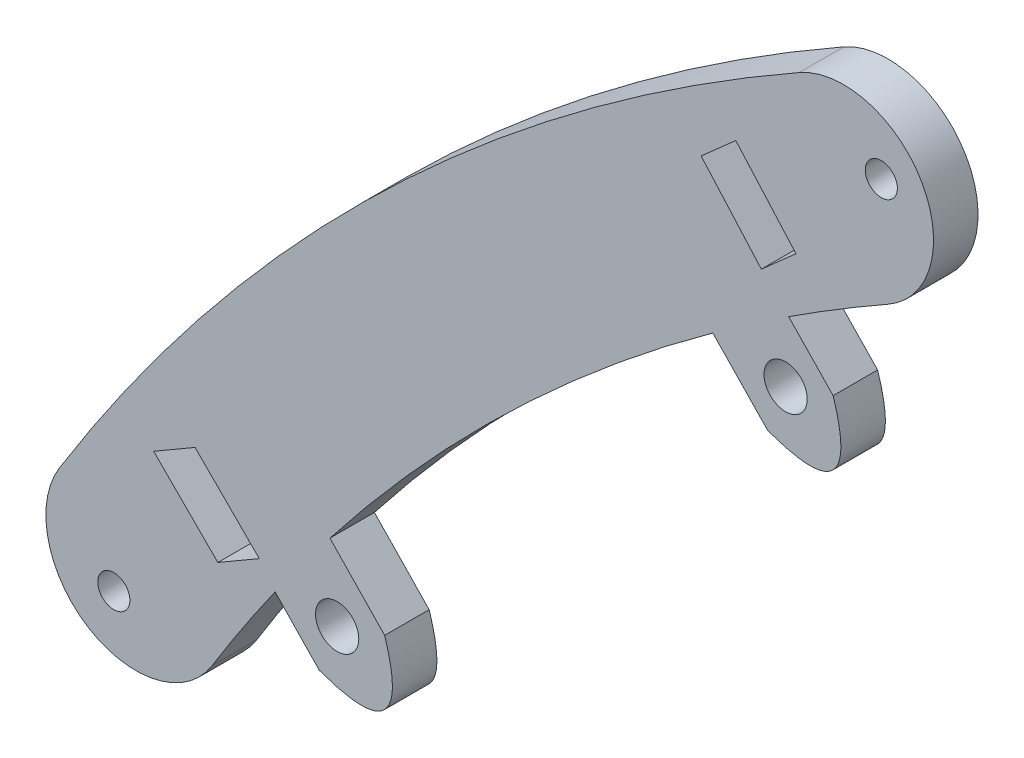
ISO-10303-21;
HEADER;
FILE_DESCRIPTION(('STEP AP214'),'2;1');
FILE_NAME('part.step','',(''),(''),'','','');
FILE_SCHEMA(('AUTOMOTIVE_DESIGN { 1 0 10303 214 1 1 1 1 }'));
ENDSEC;
DATA;
#1=APPLICATION_CONTEXT('core data for automotive mechanical design processes');
#2=APPLICATION_PROTOCOL_DEFINITION('international standard','automotive_design',2000,#1);
#3=PRODUCT_CONTEXT('',#1,'mechanical');
#4=PRODUCT('Part','Part','',(#3));
#5=PRODUCT_RELATED_PRODUCT_CATEGORY('part','',(#4));
#6=PRODUCT_DEFINITION_FORMATION('','',#4);
#7=PRODUCT_DEFINITION_CONTEXT('part definition',#1,'design');
#8=PRODUCT_DEFINITION('design','',#6,#7);
#9=PRODUCT_DEFINITION_SHAPE('','',#8);
#10=(LENGTH_UNIT() NAMED_UNIT(*) SI_UNIT(.MILLI.,.METRE.));
#11=(NAMED_UNIT(*) PLANE_ANGLE_UNIT() SI_UNIT($,.RADIAN.));
#12=(NAMED_UNIT(*) SI_UNIT($,.STERADIAN.) SOLID_ANGLE_UNIT());
#13=UNCERTAINTY_MEASURE_WITH_UNIT(LENGTH_MEASURE(1.E-05),#10,'distance_accuracy_value','');
#14=(GEOMETRIC_REPRESENTATION_CONTEXT(3) GLOBAL_UNCERTAINTY_ASSIGNED_CONTEXT((#13)) GLOBAL_UNIT_ASSIGNED_CONTEXT((#10,
#11,#12)) REPRESENTATION_CONTEXT('',''));
#15=CARTESIAN_POINT('',(0.,0.,0.));
#16=DIRECTION('',(0.,0.,1.));
#17=DIRECTION('',(1.,0.,0.));
#18=AXIS2_PLACEMENT_3D('',#15,#16,#17);
#19=CARTESIAN_POINT('',(229.674711958185,-179.16317055302,6.35));
#20=DIRECTION('',(0.,0.,-1.));
#21=DIRECTION('',(-1.,0.,0.));
#22=AXIS2_PLACEMENT_3D('',#19,#20,#21);
#23=CYLINDRICAL_SURFACE('',#22,295.200554539112);
#24=CARTESIAN_POINT('',(229.674711958185,-179.16317055302,0.));
#25=DIRECTION('',(0.,0.,1.));
#26=DIRECTION('',(1.,0.,0.));
#27=AXIS2_PLACEMENT_3D('',#24,#25,#26);
#28=CIRCLE('',#27,295.200554539112);
#29=CARTESIAN_POINT('',(84.1370748945815,77.6678314660947,0.));
#30=VERTEX_POINT('',#29);
#31=CARTESIAN_POINT('',(-21.4783743676533,-24.0325977145058,0.));
#32=VERTEX_POINT('',#31);
#33=EDGE_CURVE('E336',#30,#32,#28,.T.);
#34=ORIENTED_EDGE('',*,*,#33,.T.);
#35=DIRECTION('',(0.,0.,-1.));
#36=VECTOR('',#35,1.);
#37=CARTESIAN_POINT('',(-21.4783743676533,-24.0325977145058,6.35));
#38=LINE('',#37,#36);
#39=CARTESIAN_POINT('',(-21.4783743676533,-24.0325977145058,6.35));
#40=VERTEX_POINT('',#39);
#41=EDGE_CURVE('E11',#40,#32,#38,.T.);
#42=ORIENTED_EDGE('',*,*,#41,.F.);
#43=CARTESIAN_POINT('',(229.674711958185,-179.16317055302,6.35));
#44=DIRECTION('',(0.,0.,1.));
#45=DIRECTION('',(1.,0.,0.));
#46=AXIS2_PLACEMENT_3D('',#43,#44,#45);
#47=CIRCLE('',#46,295.200554539112);
#48=CARTESIAN_POINT('',(84.1370748945815,77.6678314660947,6.35));
#49=VERTEX_POINT('',#48);
#50=EDGE_CURVE('E223',#49,#40,#47,.T.);
#51=ORIENTED_EDGE('',*,*,#50,.F.);
#52=DIRECTION('',(0.,0.,-1.));
#53=VECTOR('',#52,1.);
#54=CARTESIAN_POINT('',(84.1370748945815,77.6678314660947,6.35));
#55=LINE('',#54,#53);
#56=EDGE_CURVE('E264',#49,#30,#55,.T.);
#57=ORIENTED_EDGE('',*,*,#56,.T.);
#58=EDGE_LOOP('',(#34,#42,#51,#57));
#59=FACE_BOUND('',#58,.T.);
#60=ADVANCED_FACE('F37',(#59),#23,.T.);
#61=CARTESIAN_POINT('',(-10.5653168250236,-30.7733027274293,6.35));
#62=DIRECTION('',(0.,0.,-1.));
#63=DIRECTION('',(-1.,0.,0.));
#64=AXIS2_PLACEMENT_3D('',#61,#62,#63);
#65=CYLINDRICAL_SURFACE('',#64,12.827);
#66=CARTESIAN_POINT('',(-10.5653168250236,-30.7733027274293,0.));
#67=DIRECTION('',(0.,0.,1.));
#68=DIRECTION('',(1.,0.,0.));
#69=AXIS2_PLACEMENT_3D('',#66,#67,#68);
#70=CIRCLE('',#69,12.827);
#71=CARTESIAN_POINT('',(0.347740717606099,-37.5140077403529,0.));
#72=VERTEX_POINT('',#71);
#73=EDGE_CURVE('E339',#32,#72,#70,.T.);
#74=ORIENTED_EDGE('',*,*,#73,.T.);
#75=DIRECTION('',(0.,0.,-1.));
#76=VECTOR('',#75,1.);
#77=CARTESIAN_POINT('',(0.347740717606099,-37.5140077403529,6.35));
#78=LINE('',#77,#76);
#79=CARTESIAN_POINT('',(0.347740717606099,-37.5140077403529,6.35));
#80=VERTEX_POINT('',#79);
#81=EDGE_CURVE('E47',#80,#72,#78,.T.);
#82=ORIENTED_EDGE('',*,*,#81,.F.);
#83=CARTESIAN_POINT('',(-10.5653168250236,-30.7733027274293,6.35));
#84=DIRECTION('',(0.,0.,1.));
#85=DIRECTION('',(1.,0.,0.));
#86=AXIS2_PLACEMENT_3D('',#83,#84,#85);
#87=CIRCLE('',#86,12.827);
#88=EDGE_CURVE('E218',#40,#80,#87,.T.);
#89=ORIENTED_EDGE('',*,*,#88,.F.);
#90=ORIENTED_EDGE('',*,*,#41,.T.);
#91=EDGE_LOOP('',(#74,#82,#89,#90));
#92=FACE_BOUND('',#91,.T.);
#93=ADVANCED_FACE('F399',(#92),#65,.T.);
#94=CARTESIAN_POINT('',(229.674711958185,-179.16317055302,6.35));
#95=DIRECTION('',(0.,0.,-1.));
#96=DIRECTION('',(-1.,0.,0.));
#97=AXIS2_PLACEMENT_3D('',#94,#95,#96);
#98=CYLINDRICAL_SURFACE('',#97,269.546554539113);
#99=CARTESIAN_POINT('',(229.674711958185,-179.16317055302,0.));
#100=DIRECTION('',(0.,0.,1.));
#101=DIRECTION('',(1.,0.,0.));
#102=AXIS2_PLACEMENT_3D('',#99,#100,#101);
#103=CIRCLE('',#102,269.546554539113);
#104=CARTESIAN_POINT('',(9.31768439930014,-23.9274611646204,0.));
#105=VERTEX_POINT('',#104);
#106=EDGE_CURVE('E342',#105,#72,#103,.T.);
#107=ORIENTED_EDGE('',*,*,#106,.F.);
#108=DIRECTION('',(0.,0.,-1.));
#109=VECTOR('',#108,1.);
#110=CARTESIAN_POINT('',(9.31768439930014,-23.9274611646204,6.35));
#111=LINE('',#110,#109);
#112=CARTESIAN_POINT('',(9.31768439930014,-23.9274611646204,6.35));
#113=VERTEX_POINT('',#112);
#114=EDGE_CURVE('E280',#113,#105,#111,.T.);
#115=ORIENTED_EDGE('',*,*,#114,.F.);
#116=CARTESIAN_POINT('',(229.674711958185,-179.16317055302,6.35));
#117=DIRECTION('',(0.,0.,1.));
#118=DIRECTION('',(1.,0.,0.));
#119=AXIS2_PLACEMENT_3D('',#116,#117,#118);
#120=CIRCLE('',#119,269.546554539113);
#121=EDGE_CURVE('E208',#113,#80,#120,.T.);
#122=ORIENTED_EDGE('',*,*,#121,.T.);
#123=ORIENTED_EDGE('',*,*,#81,.T.);
#124=EDGE_LOOP('',(#107,#115,#122,#123));
#125=FACE_BOUND('',#124,.T.);
#126=ADVANCED_FACE('F396',(#125),#98,.F.);
#127=CARTESIAN_POINT('',(-7.12046248091011,-6.85651594712229,6.35));
#128=DIRECTION('',(-0.720331621639593,-0.693629839947846,0.));
#129=DIRECTION('',(0.693629839947846,-0.720331621639593,0.));
#130=AXIS2_PLACEMENT_3D('',#127,#128,#129);
#131=PLANE('',#130);
#132=DIRECTION('',(-0.693629839947846,0.720331621639593,0.));
#133=VECTOR('',#132,1.);
#134=CARTESIAN_POINT('',(-7.12046248091011,-6.85651594712229,0.));
#135=LINE('',#134,#133);
#136=CARTESIAN_POINT('',(15.6217660169215,-30.4742229574968,0.));
#137=VERTEX_POINT('',#136);
#138=EDGE_CURVE('E345',#137,#105,#135,.T.);
#139=ORIENTED_EDGE('',*,*,#138,.F.);
#140=DIRECTION('',(0.,0.,-1.));
#141=VECTOR('',#140,1.);
#142=CARTESIAN_POINT('',(15.6217660169215,-30.4742229574968,6.35));
#143=LINE('',#142,#141);
#144=CARTESIAN_POINT('',(15.6217660169215,-30.4742229574968,6.35));
#145=VERTEX_POINT('',#144);
#146=EDGE_CURVE('E278',#145,#137,#143,.T.);
#147=ORIENTED_EDGE('',*,*,#146,.F.);
#148=DIRECTION('',(-0.693629839947846,0.720331621639593,0.));
#149=VECTOR('',#148,1.);
#150=CARTESIAN_POINT('',(-7.12046248091011,-6.85651594712229,6.35));
#151=LINE('',#150,#149);
#152=EDGE_CURVE('E217',#145,#113,#151,.T.);
#153=ORIENTED_EDGE('',*,*,#152,.T.);
#154=ORIENTED_EDGE('',*,*,#114,.T.);
#155=EDGE_LOOP('',(#139,#147,#153,#154));
#156=FACE_BOUND('',#155,.T.);
#157=ADVANCED_FACE('F394',(#156),#131,.T.);
#158=CARTESIAN_POINT('',(15.6217660169215,-30.4742229574968,6.35));
#159=CARTESIAN_POINT('',(29.4488168563122,-35.4957225427707,6.35));
#160=CARTESIAN_POINT('',(24.9529418436408,-21.4889420108124,6.35));
#161=B_SPLINE_CURVE_WITH_KNOTS('',2,(#158,#159,#160),.UNSPECIFIED.,.F.,.F.,(3,3),(0.,1.),.UNSPECIFIED.);
#162=DIRECTION('',(0.,0.,-1.));
#163=VECTOR('',#162,1.);
#164=SURFACE_OF_LINEAR_EXTRUSION('',#161,#163);
#165=CARTESIAN_POINT('',(15.6217660169215,-30.4742229574968,0.));
#166=CARTESIAN_POINT('',(29.4488168563122,-35.4957225427707,0.));
#167=CARTESIAN_POINT('',(24.9529418436408,-21.4889420108124,0.));
#168=B_SPLINE_CURVE_WITH_KNOTS('',2,(#165,#166,#167),.UNSPECIFIED.,.F.,.F.,(3,3),(0.,1.),.UNSPECIFIED.);
#169=CARTESIAN_POINT('',(24.9529418436408,-21.4889420108124,0.));
#170=VERTEX_POINT('',#169);
#171=EDGE_CURVE('E350',#137,#170,#168,.T.);
#172=ORIENTED_EDGE('',*,*,#171,.T.);
#173=DIRECTION('',(0.,0.,-1.));
#174=VECTOR('',#173,1.);
#175=CARTESIAN_POINT('',(24.9529418436408,-21.4889420108124,6.35));
#176=LINE('',#175,#174);
#177=CARTESIAN_POINT('',(24.9529418436408,-21.4889420108124,6.35));
#178=VERTEX_POINT('',#177);
#179=EDGE_CURVE('E275',#178,#170,#176,.T.);
#180=ORIENTED_EDGE('',*,*,#179,.F.);
#181=EDGE_CURVE('E222',#145,#178,#161,.T.);
#182=ORIENTED_EDGE('',*,*,#181,.F.);
#183=ORIENTED_EDGE('',*,*,#146,.T.);
#184=EDGE_LOOP('',(#172,#180,#182,#183));
#185=FACE_BOUND('',#184,.T.);
#186=ADVANCED_FACE('F390',(#185),#164,.F.);
#187=CARTESIAN_POINT('',(2.21071334580914,2.12876499956209,6.35));
#188=DIRECTION('',(-0.720331621639592,-0.693629839947847,0.));
#189=DIRECTION('',(0.693629839947847,-0.720331621639592,0.));
#190=AXIS2_PLACEMENT_3D('',#187,#188,#189);
#191=PLANE('',#190);
#192=DIRECTION('',(-0.693629839947847,0.720331621639592,0.));
#193=VECTOR('',#192,1.);
#194=CARTESIAN_POINT('',(2.21071334580914,2.12876499956209,0.));
#195=LINE('',#194,#193);
#196=CARTESIAN_POINT('',(17.1416872619347,-13.3769875419806,0.));
#197=VERTEX_POINT('',#196);
#198=EDGE_CURVE('E354',#170,#197,#195,.T.);
#199=ORIENTED_EDGE('',*,*,#198,.T.);
#200=DIRECTION('',(0.,0.,-1.));
#201=VECTOR('',#200,1.);
#202=CARTESIAN_POINT('',(17.1416872619347,-13.3769875419806,6.35));
#203=LINE('',#202,#201);
#204=CARTESIAN_POINT('',(17.1416872619347,-13.3769875419806,6.35));
#205=VERTEX_POINT('',#204);
#206=EDGE_CURVE('E273',#205,#197,#203,.T.);
#207=ORIENTED_EDGE('',*,*,#206,.F.);
#208=DIRECTION('',(-0.693629839947847,0.720331621639592,0.));
#209=VECTOR('',#208,1.);
#210=CARTESIAN_POINT('',(2.21071334580914,2.12876499956209,6.35));
#211=LINE('',#210,#209);
#212=EDGE_CURVE('E215',#178,#205,#211,.T.);
#213=ORIENTED_EDGE('',*,*,#212,.F.);
#214=ORIENTED_EDGE('',*,*,#179,.T.);
#215=EDGE_LOOP('',(#199,#207,#213,#214));
#216=FACE_BOUND('',#215,.T.);
#217=ADVANCED_FACE('F386',(#216),#191,.F.);
#218=CARTESIAN_POINT('',(71.7848233068366,39.2999341708021,0.));
#219=VERTEX_POINT('',#218);
#220=EDGE_CURVE('E347',#219,#197,#103,.T.);
#221=ORIENTED_EDGE('',*,*,#220,.F.);
#222=DIRECTION('',(0.,0.,-1.));
#223=VECTOR('',#222,1.);
#224=CARTESIAN_POINT('',(71.7848233068366,39.2999341708021,6.35));
#225=LINE('',#224,#223);
#226=CARTESIAN_POINT('',(71.7848233068366,39.2999341708021,6.35));
#227=VERTEX_POINT('',#226);
#228=EDGE_CURVE('E271',#227,#219,#225,.T.);
#229=ORIENTED_EDGE('',*,*,#228,.F.);
#230=EDGE_CURVE('E207',#227,#205,#120,.T.);
#231=ORIENTED_EDGE('',*,*,#230,.T.);
#232=ORIENTED_EDGE('',*,*,#206,.T.);
#233=EDGE_LOOP('',(#221,#229,#231,#232));
#234=FACE_BOUND('',#233,.T.);
#235=ADVANCED_FACE('F381',(#234),#98,.F.);
#236=CARTESIAN_POINT('',(56.8834970245663,54.7748977714104,6.35));
#237=DIRECTION('',(-0.720331621639599,-0.69362983994784,0.));
#238=DIRECTION('',(0.69362983994784,-0.720331621639599,0.));
#239=AXIS2_PLACEMENT_3D('',#236,#237,#238);
#240=PLANE('',#239);
#241=DIRECTION('',(-0.69362983994784,0.720331621639599,0.));
#242=VECTOR('',#241,1.);
#243=CARTESIAN_POINT('',(56.8834970245663,54.7748977714104,0.));
#244=LINE('',#243,#242);
#245=CARTESIAN_POINT('',(79.625725522398,31.1571907610353,0.));
#246=VERTEX_POINT('',#245);
#247=EDGE_CURVE('E360',#246,#219,#244,.T.);
#248=ORIENTED_EDGE('',*,*,#247,.F.);
#249=DIRECTION('',(0.,0.,-1.));
#250=VECTOR('',#249,1.);
#251=CARTESIAN_POINT('',(79.625725522398,31.1571907610353,6.35));
#252=LINE('',#251,#250);
#253=CARTESIAN_POINT('',(79.625725522398,31.1571907610353,6.35));
#254=VERTEX_POINT('',#253);
#255=EDGE_CURVE('E269',#254,#246,#252,.T.);
#256=ORIENTED_EDGE('',*,*,#255,.F.);
#257=DIRECTION('',(-0.69362983994784,0.720331621639599,0.));
#258=VECTOR('',#257,1.);
#259=CARTESIAN_POINT('',(56.8834970245663,54.7748977714104,6.35));
#260=LINE('',#259,#258);
#261=EDGE_CURVE('E214',#254,#227,#260,.T.);
#262=ORIENTED_EDGE('',*,*,#261,.T.);
#263=ORIENTED_EDGE('',*,*,#228,.T.);
#264=EDGE_LOOP('',(#248,#256,#262,#263));
#265=FACE_BOUND('',#264,.T.);
#266=ADVANCED_FACE('F508',(#265),#240,.T.);
#267=CARTESIAN_POINT('',(79.625725522398,31.1571907610353,6.35));
#268=CARTESIAN_POINT('',(93.4527763617898,26.1356911757603,6.35));
#269=CARTESIAN_POINT('',(88.9569013491174,40.1424717077196,6.35));
#270=B_SPLINE_CURVE_WITH_KNOTS('',2,(#267,#268,#269),.UNSPECIFIED.,.F.,.F.,(3,3),(0.,1.),.UNSPECIFIED.);
#271=DIRECTION('',(0.,0.,-1.));
#272=VECTOR('',#271,1.);
#273=SURFACE_OF_LINEAR_EXTRUSION('',#270,#272);
#274=CARTESIAN_POINT('',(79.625725522398,31.1571907610353,0.));
#275=CARTESIAN_POINT('',(93.4527763617898,26.1356911757603,0.));
#276=CARTESIAN_POINT('',(88.9569013491174,40.1424717077196,0.));
#277=B_SPLINE_CURVE_WITH_KNOTS('',2,(#274,#275,#276),.UNSPECIFIED.,.F.,.F.,(3,3),(0.,1.),.UNSPECIFIED.);
#278=CARTESIAN_POINT('',(88.9569013491174,40.1424717077196,0.));
#279=VERTEX_POINT('',#278);
#280=EDGE_CURVE('E363',#246,#279,#277,.T.);
#281=ORIENTED_EDGE('',*,*,#280,.T.);
#282=DIRECTION('',(0.,0.,-1.));
#283=VECTOR('',#282,1.);
#284=CARTESIAN_POINT('',(88.9569013491174,40.1424717077196,6.35));
#285=LINE('',#284,#283);
#286=CARTESIAN_POINT('',(88.9569013491174,40.1424717077196,6.35));
#287=VERTEX_POINT('',#286);
#288=EDGE_CURVE('E203',#287,#279,#285,.T.);
#289=ORIENTED_EDGE('',*,*,#288,.F.);
#290=EDGE_CURVE('E190',#254,#287,#270,.T.);
#291=ORIENTED_EDGE('',*,*,#290,.F.);
#292=ORIENTED_EDGE('',*,*,#255,.T.);
#293=EDGE_LOOP('',(#281,#289,#291,#292));
#294=FACE_BOUND('',#293,.T.);
#295=ADVANCED_FACE('F504',(#294),#273,.F.);
#296=CARTESIAN_POINT('',(66.2146728512855,63.7601787180948,6.35));
#297=DIRECTION('',(-0.720331621639598,-0.693629839947841,0.));
#298=DIRECTION('',(0.693629839947841,-0.720331621639598,0.));
#299=AXIS2_PLACEMENT_3D('',#296,#297,#298);
#300=PLANE('',#299);
#301=DIRECTION('',(-0.693629839947841,0.720331621639598,0.));
#302=VECTOR('',#301,1.);
#303=CARTESIAN_POINT('',(66.2146728512855,63.7601787180948,0.));
#304=LINE('',#303,#302);
#305=CARTESIAN_POINT('',(82.6127266678664,46.7308699756691,0.));
#306=VERTEX_POINT('',#305);
#307=EDGE_CURVE('E199',#279,#306,#304,.T.);
#308=ORIENTED_EDGE('',*,*,#307,.T.);
#309=DIRECTION('',(0.,0.,-1.));
#310=VECTOR('',#309,1.);
#311=CARTESIAN_POINT('',(82.6127266678664,46.7308699756691,6.35));
#312=LINE('',#311,#310);
#313=CARTESIAN_POINT('',(82.6127266678664,46.7308699756691,6.35));
#314=VERTEX_POINT('',#313);
#315=EDGE_CURVE('E196',#314,#306,#312,.T.);
#316=ORIENTED_EDGE('',*,*,#315,.F.);
#317=DIRECTION('',(-0.693629839947841,0.720331621639598,0.));
#318=VECTOR('',#317,1.);
#319=CARTESIAN_POINT('',(66.2146728512855,63.7601787180948,6.35));
#320=LINE('',#319,#318);
#321=EDGE_CURVE('E182',#287,#314,#320,.T.);
#322=ORIENTED_EDGE('',*,*,#321,.F.);
#323=ORIENTED_EDGE('',*,*,#288,.T.);
#324=EDGE_LOOP('',(#308,#316,#322,#323));
#325=FACE_BOUND('',#324,.T.);
#326=ADVANCED_FACE('F197',(#325),#300,.F.);
#327=CARTESIAN_POINT('',(96.7848239716755,55.3482848917831,0.));
#328=VERTEX_POINT('',#327);
#329=EDGE_CURVE('E346',#328,#306,#103,.T.);
#330=ORIENTED_EDGE('',*,*,#329,.F.);
#331=DIRECTION('',(0.,0.,-1.));
#332=VECTOR('',#331,1.);
#333=CARTESIAN_POINT('',(96.7848239716755,55.3482848917831,6.35));
#334=LINE('',#333,#332);
#335=CARTESIAN_POINT('',(96.7848239716755,55.3482848917831,6.35));
#336=VERTEX_POINT('',#335);
#337=EDGE_CURVE('E120',#336,#328,#334,.T.);
#338=ORIENTED_EDGE('',*,*,#337,.F.);
#339=EDGE_CURVE('E187',#336,#314,#120,.T.);
#340=ORIENTED_EDGE('',*,*,#339,.T.);
#341=ORIENTED_EDGE('',*,*,#315,.T.);
#342=EDGE_LOOP('',(#330,#338,#340,#341));
#343=FACE_BOUND('',#342,.T.);
#344=ADVANCED_FACE('F205',(#343),#98,.F.);
#345=CARTESIAN_POINT('',(-6.94480742537235,-6.94480742537235,6.35));
#346=DIRECTION('',(0.707106781186547,0.707106781186548,0.));
#347=DIRECTION('',(-0.707106781186548,0.707106781186547,0.));
#348=AXIS2_PLACEMENT_3D('',#345,#346,#347);
#349=PLANE('',#348);
#350=DIRECTION('',(0.707106781186548,-0.707106781186547,0.));
#351=VECTOR('',#350,1.);
#352=CARTESIAN_POINT('',(-6.94480742537235,-6.94480742537235,0.));
#353=LINE('',#352,#351);
#354=CARTESIAN_POINT('',(-2.10093048234013,-11.7886843684046,0.));
#355=VERTEX_POINT('',#354);
#356=CARTESIAN_POINT('',(7.0605629144832,-20.9501777652279,0.));
#357=VERTEX_POINT('',#356);
#358=EDGE_CURVE('E324',#355,#357,#353,.T.);
#359=ORIENTED_EDGE('',*,*,#358,.T.);
#360=DIRECTION('',(0.,0.,-1.));
#361=VECTOR('',#360,1.);
#362=CARTESIAN_POINT('',(7.0605629144832,-20.9501777652279,6.35));
#363=LINE('',#362,#361);
#364=CARTESIAN_POINT('',(7.0605629144832,-20.9501777652279,6.35));
#365=VERTEX_POINT('',#364);
#366=EDGE_CURVE('E266',#365,#357,#363,.T.);
#367=ORIENTED_EDGE('',*,*,#366,.F.);
#368=DIRECTION('',(0.707106781186548,-0.707106781186547,0.));
#369=VECTOR('',#368,1.);
#370=CARTESIAN_POINT('',(-6.94480742537235,-6.94480742537235,6.35));
#371=LINE('',#370,#369);
#372=CARTESIAN_POINT('',(-2.10093048234013,-11.7886843684046,6.35));
#373=VERTEX_POINT('',#372);
#374=EDGE_CURVE('E235',#373,#365,#371,.T.);
#375=ORIENTED_EDGE('',*,*,#374,.F.);
#376=DIRECTION('',(0.,0.,-1.));
#377=VECTOR('',#376,1.);
#378=CARTESIAN_POINT('',(-2.10093048234013,-11.7886843684046,6.35));
#379=LINE('',#378,#377);
#380=EDGE_CURVE('E283',#373,#355,#379,.T.);
#381=ORIENTED_EDGE('',*,*,#380,.T.);
#382=EDGE_LOOP('',(#359,#367,#375,#381));
#383=FACE_BOUND('',#382,.T.);
#384=ADVANCED_FACE('F433',(#383),#349,.F.);
#385=CARTESIAN_POINT('',(10.8733608503817,-18.737628400949,6.35));
#386=DIRECTION('',(0.501909305167918,-0.864920256084836,0.));
#387=DIRECTION('',(0.864920256084836,0.501909305167918,0.));
#388=AXIS2_PLACEMENT_3D('',#385,#386,#387);
#389=PLANE('',#388);
#390=DIRECTION('',(-0.864920256084836,-0.501909305167918,0.));
#391=VECTOR('',#390,1.);
#392=CARTESIAN_POINT('',(10.8733608503817,-18.737628400949,0.));
#393=LINE('',#392,#391);
#394=CARTESIAN_POINT('',(1.15061344463446,-24.37969466129,0.));
#395=VERTEX_POINT('',#394);
#396=EDGE_CURVE('E327',#357,#395,#393,.T.);
#397=ORIENTED_EDGE('',*,*,#396,.T.);
#398=DIRECTION('',(0.,0.,-1.));
#399=VECTOR('',#398,1.);
#400=CARTESIAN_POINT('',(1.15061344463446,-24.37969466129,6.35));
#401=LINE('',#400,#399);
#402=CARTESIAN_POINT('',(1.15061344463446,-24.37969466129,6.35));
#403=VERTEX_POINT('',#402);
#404=EDGE_CURVE('E287',#403,#395,#401,.T.);
#405=ORIENTED_EDGE('',*,*,#404,.F.);
#406=DIRECTION('',(-0.864920256084836,-0.501909305167918,0.));
#407=VECTOR('',#406,1.);
#408=CARTESIAN_POINT('',(10.8733608503817,-18.737628400949,6.35));
#409=LINE('',#408,#407);
#410=EDGE_CURVE('E233',#365,#403,#409,.T.);
#411=ORIENTED_EDGE('',*,*,#410,.F.);
#412=ORIENTED_EDGE('',*,*,#366,.T.);
#413=EDGE_LOOP('',(#397,#405,#411,#412));
#414=FACE_BOUND('',#413,.T.);
#415=ADVANCED_FACE('F429',(#414),#389,.F.);
#416=CARTESIAN_POINT('',(-11.6145406083278,-11.6145406083278,6.35));
#417=DIRECTION('',(0.707106781186547,0.707106781186548,0.));
#418=DIRECTION('',(-0.707106781186548,0.707106781186547,0.));
#419=AXIS2_PLACEMENT_3D('',#416,#417,#418);
#420=PLANE('',#419);
#421=DIRECTION('',(0.707106781186548,-0.707106781186547,0.));
#422=VECTOR('',#421,1.);
#423=CARTESIAN_POINT('',(-11.6145406083278,-11.6145406083278,0.));
#424=LINE('',#423,#422);
#425=CARTESIAN_POINT('',(-8.01087995218896,-15.2182012644665,0.));
#426=VERTEX_POINT('',#425);
#427=EDGE_CURVE('E330',#426,#395,#424,.T.);
#428=ORIENTED_EDGE('',*,*,#427,.F.);
#429=DIRECTION('',(0.,0.,-1.));
#430=VECTOR('',#429,1.);
#431=CARTESIAN_POINT('',(-8.01087995218896,-15.2182012644665,6.35));
#432=LINE('',#431,#430);
#433=CARTESIAN_POINT('',(-8.01087995218896,-15.2182012644665,6.35));
#434=VERTEX_POINT('',#433);
#435=EDGE_CURVE('E285',#434,#426,#432,.T.);
#436=ORIENTED_EDGE('',*,*,#435,.F.);
#437=DIRECTION('',(0.707106781186548,-0.707106781186547,0.));
#438=VECTOR('',#437,1.);
#439=CARTESIAN_POINT('',(-11.6145406083278,-11.6145406083278,6.35));
#440=LINE('',#439,#438);
#441=EDGE_CURVE('E230',#434,#403,#440,.T.);
#442=ORIENTED_EDGE('',*,*,#441,.T.);
#443=ORIENTED_EDGE('',*,*,#404,.T.);
#444=EDGE_LOOP('',(#428,#436,#442,#443));
#445=FACE_BOUND('',#444,.T.);
#446=ADVANCED_FACE('F426',(#445),#420,.T.);
#447=CARTESIAN_POINT('',(74.1668802422229,65.7311017479108,6.35));
#448=DIRECTION('',(0.748385625500297,0.66326386570092,0.));
#449=DIRECTION('',(-0.66326386570092,0.748385625500298,0.));
#450=AXIS2_PLACEMENT_3D('',#447,#448,#449);
#451=PLANE('',#450);
#452=DIRECTION('',(0.66326386570092,-0.748385625500298,0.));
#453=VECTOR('',#452,1.);
#454=CARTESIAN_POINT('',(74.1668802422229,65.7311017479108,0.));
#455=LINE('',#454,#453);
#456=CARTESIAN_POINT('',(75.0607858043629,64.7224744008544,0.));
#457=VERTEX_POINT('',#456);
#458=CARTESIAN_POINT('',(83.6527059206434,55.0278870081339,0.));
#459=VERTEX_POINT('',#458);
#460=EDGE_CURVE('E307',#457,#459,#455,.T.);
#461=ORIENTED_EDGE('',*,*,#460,.T.);
#462=DIRECTION('',(0.,0.,-1.));
#463=VECTOR('',#462,1.);
#464=CARTESIAN_POINT('',(83.6527059206434,55.0278870081339,6.35));
#465=LINE('',#464,#463);
#466=CARTESIAN_POINT('',(83.6527059206434,55.0278870081339,6.35));
#467=VERTEX_POINT('',#466);
#468=EDGE_CURVE('E41',#467,#459,#465,.T.);
#469=ORIENTED_EDGE('',*,*,#468,.F.);
#470=DIRECTION('',(0.66326386570092,-0.748385625500298,0.));
#471=VECTOR('',#470,1.);
#472=CARTESIAN_POINT('',(74.1668802422229,65.7311017479108,6.35));
#473=LINE('',#472,#471);
#474=CARTESIAN_POINT('',(75.0607858043629,64.7224744008544,6.35));
#475=VERTEX_POINT('',#474);
#476=EDGE_CURVE('E245',#475,#467,#473,.T.);
#477=ORIENTED_EDGE('',*,*,#476,.F.);
#478=DIRECTION('',(0.,0.,-1.));
#479=VECTOR('',#478,1.);
#480=CARTESIAN_POINT('',(75.0607858043629,64.7224744008544,6.35));
#481=LINE('',#480,#479);
#482=EDGE_CURVE('E291',#475,#457,#481,.T.);
#483=ORIENTED_EDGE('',*,*,#482,.T.);
#484=EDGE_LOOP('',(#461,#469,#477,#483));
#485=FACE_BOUND('',#484,.T.);
#486=ADVANCED_FACE('F308',(#485),#451,.F.);
#487=CARTESIAN_POINT('',(9.48582567842048,-10.7032147397769,6.35));
#488=DIRECTION('',(0.66326386570092,-0.748385625500297,0.));
#489=DIRECTION('',(0.748385625500298,0.66326386570092,0.));
#490=AXIS2_PLACEMENT_3D('',#487,#488,#489);
#491=PLANE('',#490);
#492=DIRECTION('',(-0.748385625500298,-0.66326386570092,0.));
#493=VECTOR('',#492,1.);
#494=CARTESIAN_POINT('',(9.48582567842048,-10.7032147397769,0.));
#495=LINE('',#494,#493);
#496=CARTESIAN_POINT('',(78.7103672498394,50.6476924390451,0.));
#497=VERTEX_POINT('',#496);
#498=EDGE_CURVE('E302',#459,#497,#495,.T.);
#499=ORIENTED_EDGE('',*,*,#498,.T.);
#500=DIRECTION('',(0.,0.,-1.));
#501=VECTOR('',#500,1.);
#502=CARTESIAN_POINT('',(78.7103672498394,50.6476924390451,6.35));
#503=LINE('',#502,#501);
#504=CARTESIAN_POINT('',(78.7103672498394,50.6476924390451,6.35));
#505=VERTEX_POINT('',#504);
#506=EDGE_CURVE('E295',#505,#497,#503,.T.);
#507=ORIENTED_EDGE('',*,*,#506,.F.);
#508=DIRECTION('',(-0.748385625500298,-0.66326386570092,0.));
#509=VECTOR('',#508,1.);
#510=CARTESIAN_POINT('',(9.48582567842048,-10.7032147397769,6.35));
#511=LINE('',#510,#509);
#512=EDGE_CURVE('E132',#467,#505,#511,.T.);
#513=ORIENTED_EDGE('',*,*,#512,.F.);
#514=ORIENTED_EDGE('',*,*,#468,.T.);
#515=EDGE_LOOP('',(#499,#507,#513,#514));
#516=FACE_BOUND('',#515,.T.);
#517=ADVANCED_FACE('F301',(#516),#491,.F.);
#518=CARTESIAN_POINT('',(69.2245415714189,61.350907178822,6.35));
#519=DIRECTION('',(0.748385625500297,0.66326386570092,0.));
#520=DIRECTION('',(-0.66326386570092,0.748385625500298,0.));
#521=AXIS2_PLACEMENT_3D('',#518,#519,#520);
#522=PLANE('',#521);
#523=DIRECTION('',(0.66326386570092,-0.748385625500298,0.));
#524=VECTOR('',#523,1.);
#525=CARTESIAN_POINT('',(69.2245415714189,61.350907178822,0.));
#526=LINE('',#525,#524);
#527=CARTESIAN_POINT('',(70.1184471335589,60.3422798317655,0.));
#528=VERTEX_POINT('',#527);
#529=EDGE_CURVE('E314',#528,#497,#526,.T.);
#530=ORIENTED_EDGE('',*,*,#529,.F.);
#531=DIRECTION('',(0.,0.,-1.));
#532=VECTOR('',#531,1.);
#533=CARTESIAN_POINT('',(70.1184471335589,60.3422798317655,6.35));
#534=LINE('',#533,#532);
#535=CARTESIAN_POINT('',(70.1184471335589,60.3422798317655,6.35));
#536=VERTEX_POINT('',#535);
#537=EDGE_CURVE('E293',#536,#528,#534,.T.);
#538=ORIENTED_EDGE('',*,*,#537,.F.);
#539=DIRECTION('',(0.66326386570092,-0.748385625500298,0.));
#540=VECTOR('',#539,1.);
#541=CARTESIAN_POINT('',(69.2245415714189,61.350907178822,6.35));
#542=LINE('',#541,#540);
#543=EDGE_CURVE('E241',#536,#505,#542,.T.);
#544=ORIENTED_EDGE('',*,*,#543,.T.);
#545=ORIENTED_EDGE('',*,*,#506,.T.);
#546=EDGE_LOOP('',(#530,#538,#544,#545));
#547=FACE_BOUND('',#546,.T.);
#548=ADVANCED_FACE('F414',(#547),#522,.T.);
#549=CARTESIAN_POINT('',(18.1731656441368,-23.786006992875,6.35));
#550=DIRECTION('',(0.,0.,-1.));
#551=DIRECTION('',(-1.,0.,0.));
#552=AXIS2_PLACEMENT_3D('',#549,#550,#551);
#553=CYLINDRICAL_SURFACE('',#552,3.0861);
#554=CARTESIAN_POINT('',(18.1731656441368,-23.786006992875,6.35));
#555=DIRECTION('',(0.,0.,1.));
#556=DIRECTION('',(1.,0.,0.));
#557=AXIS2_PLACEMENT_3D('',#554,#555,#556);
#558=CIRCLE('',#557,3.0861);
#559=CARTESIAN_POINT('',(21.2592656441368,-23.786006992875,6.35));
#560=VERTEX_POINT('',#559);
#561=EDGE_CURVE('E209',#560,#560,#558,.T.);
#562=ORIENTED_EDGE('',*,*,#561,.T.);
#563=EDGE_LOOP('',(#562));
#564=FACE_BOUND('',#563,.T.);
#565=CARTESIAN_POINT('',(18.1731656441368,-23.786006992875,0.));
#566=DIRECTION('',(0.,0.,1.));
#567=DIRECTION('',(1.,0.,0.));
#568=AXIS2_PLACEMENT_3D('',#565,#566,#567);
#569=CIRCLE('',#568,3.0861);
#570=CARTESIAN_POINT('',(21.2592656441368,-23.786006992875,0.));
#571=VERTEX_POINT('',#570);
#572=EDGE_CURVE('E256',#571,#571,#569,.T.);
#573=ORIENTED_EDGE('',*,*,#572,.F.);
#574=EDGE_LOOP('',(#573));
#575=FACE_BOUND('',#574,.T.);
#576=ADVANCED_FACE('F405',(#564,#575),#553,.F.);
#577=CARTESIAN_POINT('',(90.4609494331284,66.5080581789389,6.35));
#578=DIRECTION('',(0.,0.,-1.));
#579=DIRECTION('',(-1.,0.,0.));
#580=AXIS2_PLACEMENT_3D('',#577,#578,#579);
#581=CYLINDRICAL_SURFACE('',#580,12.827);
#582=CARTESIAN_POINT('',(90.4609494331284,66.5080581789389,0.));
#583=DIRECTION('',(0.,0.,1.));
#584=DIRECTION('',(1.,0.,0.));
#585=AXIS2_PLACEMENT_3D('',#582,#583,#584);
#586=CIRCLE('',#585,12.827);
#587=EDGE_CURVE('E123',#328,#30,#586,.T.);
#588=ORIENTED_EDGE('',*,*,#587,.T.);
#589=ORIENTED_EDGE('',*,*,#56,.F.);
#590=CARTESIAN_POINT('',(90.4609494331284,66.5080581789389,6.35));
#591=DIRECTION('',(0.,0.,1.));
#592=DIRECTION('',(1.,0.,0.));
#593=AXIS2_PLACEMENT_3D('',#590,#591,#592);
#594=CIRCLE('',#593,12.827);
#595=EDGE_CURVE('E56',#336,#49,#594,.T.);
#596=ORIENTED_EDGE('',*,*,#595,.F.);
#597=ORIENTED_EDGE('',*,*,#337,.T.);
#598=EDGE_LOOP('',(#588,#589,#596,#597));
#599=FACE_BOUND('',#598,.T.);
#600=ADVANCED_FACE('F402',(#599),#581,.T.);
#601=CARTESIAN_POINT('',(4.58835214920787,-7.90692397020364,6.35));
#602=DIRECTION('',(0.501909305167901,-0.864920256084846,0.));
#603=DIRECTION('',(0.864920256084846,0.501909305167901,0.));
#604=AXIS2_PLACEMENT_3D('',#601,#602,#603);
#605=PLANE('',#604);
#606=DIRECTION('',(-0.864920256084846,-0.501909305167901,0.));
#607=VECTOR('',#606,1.);
#608=CARTESIAN_POINT('',(4.58835214920787,-7.90692397020364,0.));
#609=LINE('',#608,#607);
#610=EDGE_CURVE('E333',#355,#426,#609,.T.);
#611=ORIENTED_EDGE('',*,*,#610,.F.);
#612=ORIENTED_EDGE('',*,*,#380,.F.);
#613=DIRECTION('',(-0.864920256084846,-0.501909305167901,0.));
#614=VECTOR('',#613,1.);
#615=CARTESIAN_POINT('',(4.58835214920787,-7.90692397020364,6.35));
#616=LINE('',#615,#614);
#617=EDGE_CURVE('E225',#373,#434,#616,.T.);
#618=ORIENTED_EDGE('',*,*,#617,.T.);
#619=ORIENTED_EDGE('',*,*,#435,.T.);
#620=EDGE_LOOP('',(#611,#612,#618,#619));
#621=FACE_BOUND('',#620,.T.);
#622=ADVANCED_FACE('F404',(#621),#605,.T.);
#623=CARTESIAN_POINT('',(0.893905562139995,-1.00862734705647,6.35));
#624=DIRECTION('',(0.66326386570092,-0.748385625500297,0.));
#625=DIRECTION('',(0.748385625500298,0.66326386570092,0.));
#626=AXIS2_PLACEMENT_3D('',#623,#624,#625);
#627=PLANE('',#626);
#628=DIRECTION('',(-0.748385625500298,-0.66326386570092,0.));
#629=VECTOR('',#628,1.);
#630=CARTESIAN_POINT('',(0.893905562139995,-1.00862734705647,0.));
#631=LINE('',#630,#629);
#632=EDGE_CURVE('E322',#457,#528,#631,.T.);
#633=ORIENTED_EDGE('',*,*,#632,.F.);
#634=ORIENTED_EDGE('',*,*,#482,.F.);
#635=DIRECTION('',(-0.748385625500298,-0.66326386570092,0.));
#636=VECTOR('',#635,1.);
#637=CARTESIAN_POINT('',(0.893905562139995,-1.00862734705647,6.35));
#638=LINE('',#637,#636);
#639=EDGE_CURVE('E238',#475,#536,#638,.T.);
#640=ORIENTED_EDGE('',*,*,#639,.T.);
#641=ORIENTED_EDGE('',*,*,#537,.T.);
#642=EDGE_LOOP('',(#633,#634,#640,#641));
#643=FACE_BOUND('',#642,.T.);
#644=ADVANCED_FACE('F411',(#643),#627,.T.);
#645=CARTESIAN_POINT('',(-13.6994246682668,-35.3440423781478,6.35));
#646=DIRECTION('',(0.,0.,-1.));
#647=DIRECTION('',(-1.,0.,0.));
#648=AXIS2_PLACEMENT_3D('',#645,#646,#647);
#649=CYLINDRICAL_SURFACE('',#648,2.29235);
#650=CARTESIAN_POINT('',(-13.6994246682668,-35.3440423781478,6.35));
#651=DIRECTION('',(0.,0.,1.));
#652=DIRECTION('',(1.,0.,0.));
#653=AXIS2_PLACEMENT_3D('',#650,#651,#652);
#654=CIRCLE('',#653,2.29235);
#655=CARTESIAN_POINT('',(-11.4070746682668,-35.3440423781478,6.35));
#656=VERTEX_POINT('',#655);
#657=EDGE_CURVE('E247',#656,#656,#654,.T.);
#658=ORIENTED_EDGE('',*,*,#657,.T.);
#659=EDGE_LOOP('',(#658));
#660=FACE_BOUND('',#659,.T.);
#661=CARTESIAN_POINT('',(-13.6994246682668,-35.3440423781478,0.));
#662=DIRECTION('',(0.,0.,1.));
#663=DIRECTION('',(1.,0.,0.));
#664=AXIS2_PLACEMENT_3D('',#661,#662,#663);
#665=CIRCLE('',#664,2.29235);
#666=CARTESIAN_POINT('',(-11.4070746682668,-35.3440423781478,0.));
#667=VERTEX_POINT('',#666);
#668=EDGE_CURVE('E312',#667,#667,#665,.T.);
#669=ORIENTED_EDGE('',*,*,#668,.F.);
#670=EDGE_LOOP('',(#669));
#671=FACE_BOUND('',#670,.T.);
#672=ADVANCED_FACE('F440',(#660,#671),#649,.F.);
#673=CARTESIAN_POINT('',(95.8324844406927,70.3376202484941,6.35));
#674=DIRECTION('',(0.,0.,-1.));
#675=DIRECTION('',(-1.,0.,0.));
#676=AXIS2_PLACEMENT_3D('',#673,#674,#675);
#677=CYLINDRICAL_SURFACE('',#676,2.29235);
#678=CARTESIAN_POINT('',(95.8324844406927,70.3376202484941,6.35));
#679=DIRECTION('',(0.,0.,1.));
#680=DIRECTION('',(1.,0.,0.));
#681=AXIS2_PLACEMENT_3D('',#678,#679,#680);
#682=CIRCLE('',#681,2.29235);
#683=CARTESIAN_POINT('',(98.1248344406927,70.3376202484941,6.35));
#684=VERTEX_POINT('',#683);
#685=EDGE_CURVE('E250',#684,#684,#682,.T.);
#686=ORIENTED_EDGE('',*,*,#685,.T.);
#687=EDGE_LOOP('',(#686));
#688=FACE_BOUND('',#687,.T.);
#689=CARTESIAN_POINT('',(95.8324844406927,70.3376202484941,0.));
#690=DIRECTION('',(0.,0.,1.));
#691=DIRECTION('',(1.,0.,0.));
#692=AXIS2_PLACEMENT_3D('',#689,#690,#691);
#693=CIRCLE('',#692,2.29235);
#694=CARTESIAN_POINT('',(98.1248344406927,70.3376202484941,0.));
#695=VERTEX_POINT('',#694);
#696=EDGE_CURVE('E317',#695,#695,#693,.T.);
#697=ORIENTED_EDGE('',*,*,#696,.F.);
#698=EDGE_LOOP('',(#697));
#699=FACE_BOUND('',#698,.T.);
#700=ADVANCED_FACE('F39',(#688,#699),#677,.F.);
#701=CARTESIAN_POINT('',(82.1771258367742,37.8454028501245,6.35));
#702=DIRECTION('',(0.,0.,-1.));
#703=DIRECTION('',(-1.,0.,0.));
#704=AXIS2_PLACEMENT_3D('',#701,#702,#703);
#705=CYLINDRICAL_SURFACE('',#704,3.0861);
#706=CARTESIAN_POINT('',(82.1771258367742,37.8454028501245,6.35));
#707=DIRECTION('',(0.,0.,1.));
#708=DIRECTION('',(1.,0.,0.));
#709=AXIS2_PLACEMENT_3D('',#706,#707,#708);
#710=CIRCLE('',#709,3.0861);
#711=CARTESIAN_POINT('',(85.2632258367742,37.8454028501245,6.35));
#712=VERTEX_POINT('',#711);
#713=EDGE_CURVE('E294',#712,#712,#710,.T.);
#714=ORIENTED_EDGE('',*,*,#713,.T.);
#715=EDGE_LOOP('',(#714));
#716=FACE_BOUND('',#715,.T.);
#717=CARTESIAN_POINT('',(82.1771258367742,37.8454028501245,0.));
#718=DIRECTION('',(0.,0.,1.));
#719=DIRECTION('',(1.,0.,0.));
#720=AXIS2_PLACEMENT_3D('',#717,#718,#719);
#721=CIRCLE('',#720,3.0861);
#722=CARTESIAN_POINT('',(85.2632258367742,37.8454028501245,0.));
#723=VERTEX_POINT('',#722);
#724=EDGE_CURVE('E252',#723,#723,#721,.T.);
#725=ORIENTED_EDGE('',*,*,#724,.F.);
#726=EDGE_LOOP('',(#725));
#727=FACE_BOUND('',#726,.T.);
#728=ADVANCED_FACE('F452',(#716,#727),#705,.F.);
#729=CARTESIAN_POINT('',(0.,0.,6.35));
#730=DIRECTION('',(0.,0.,1.));
#731=DIRECTION('',(1.,0.,0.));
#732=AXIS2_PLACEMENT_3D('',#729,#730,#731);
#733=PLANE('',#732);
#734=ORIENTED_EDGE('',*,*,#685,.F.);
#735=EDGE_LOOP('',(#734));
#736=FACE_BOUND('',#735,.T.);
#737=ORIENTED_EDGE('',*,*,#657,.F.);
#738=EDGE_LOOP('',(#737));
#739=FACE_BOUND('',#738,.T.);
#740=ORIENTED_EDGE('',*,*,#476,.T.);
#741=ORIENTED_EDGE('',*,*,#512,.T.);
#742=ORIENTED_EDGE('',*,*,#543,.F.);
#743=ORIENTED_EDGE('',*,*,#639,.F.);
#744=EDGE_LOOP('',(#740,#741,#742,#743));
#745=FACE_BOUND('',#744,.T.);
#746=ORIENTED_EDGE('',*,*,#374,.T.);
#747=ORIENTED_EDGE('',*,*,#410,.T.);
#748=ORIENTED_EDGE('',*,*,#441,.F.);
#749=ORIENTED_EDGE('',*,*,#617,.F.);
#750=EDGE_LOOP('',(#746,#747,#748,#749));
#751=FACE_BOUND('',#750,.T.);
#752=ORIENTED_EDGE('',*,*,#50,.T.);
#753=ORIENTED_EDGE('',*,*,#88,.T.);
#754=ORIENTED_EDGE('',*,*,#121,.F.);
#755=ORIENTED_EDGE('',*,*,#152,.F.);
#756=ORIENTED_EDGE('',*,*,#181,.T.);
#757=ORIENTED_EDGE('',*,*,#212,.T.);
#758=ORIENTED_EDGE('',*,*,#230,.F.);
#759=ORIENTED_EDGE('',*,*,#261,.F.);
#760=ORIENTED_EDGE('',*,*,#290,.T.);
#761=ORIENTED_EDGE('',*,*,#321,.T.);
#762=ORIENTED_EDGE('',*,*,#339,.F.);
#763=ORIENTED_EDGE('',*,*,#595,.T.);
#764=EDGE_LOOP('',(#752,#753,#754,#755,#756,#757,#758,#759,#760,#761,#762,#763));
#765=FACE_BOUND('',#764,.T.);
#766=ORIENTED_EDGE('',*,*,#561,.F.);
#767=EDGE_LOOP('',(#766));
#768=FACE_BOUND('',#767,.T.);
#769=ORIENTED_EDGE('',*,*,#713,.F.);
#770=EDGE_LOOP('',(#769));
#771=FACE_BOUND('',#770,.T.);
#772=ADVANCED_FACE('F184',(#736,#739,#745,#751,#765,#768,#771),#733,.T.);
#773=CARTESIAN_POINT('',(0.,0.,0.));
#774=DIRECTION('',(0.,0.,1.));
#775=DIRECTION('',(1.,0.,0.));
#776=AXIS2_PLACEMENT_3D('',#773,#774,#775);
#777=PLANE('',#776);
#778=ORIENTED_EDGE('',*,*,#696,.T.);
#779=EDGE_LOOP('',(#778));
#780=FACE_BOUND('',#779,.T.);
#781=ORIENTED_EDGE('',*,*,#668,.T.);
#782=EDGE_LOOP('',(#781));
#783=FACE_BOUND('',#782,.T.);
#784=ORIENTED_EDGE('',*,*,#460,.F.);
#785=ORIENTED_EDGE('',*,*,#632,.T.);
#786=ORIENTED_EDGE('',*,*,#529,.T.);
#787=ORIENTED_EDGE('',*,*,#498,.F.);
#788=EDGE_LOOP('',(#784,#785,#786,#787));
#789=FACE_BOUND('',#788,.T.);
#790=ORIENTED_EDGE('',*,*,#358,.F.);
#791=ORIENTED_EDGE('',*,*,#610,.T.);
#792=ORIENTED_EDGE('',*,*,#427,.T.);
#793=ORIENTED_EDGE('',*,*,#396,.F.);
#794=EDGE_LOOP('',(#790,#791,#792,#793));
#795=FACE_BOUND('',#794,.T.);
#796=ORIENTED_EDGE('',*,*,#33,.F.);
#797=ORIENTED_EDGE('',*,*,#587,.F.);
#798=ORIENTED_EDGE('',*,*,#329,.T.);
#799=ORIENTED_EDGE('',*,*,#307,.F.);
#800=ORIENTED_EDGE('',*,*,#280,.F.);
#801=ORIENTED_EDGE('',*,*,#247,.T.);
#802=ORIENTED_EDGE('',*,*,#220,.T.);
#803=ORIENTED_EDGE('',*,*,#198,.F.);
#804=ORIENTED_EDGE('',*,*,#171,.F.);
#805=ORIENTED_EDGE('',*,*,#138,.T.);
#806=ORIENTED_EDGE('',*,*,#106,.T.);
#807=ORIENTED_EDGE('',*,*,#73,.F.);
#808=EDGE_LOOP('',(#796,#797,#798,#799,#800,#801,#802,#803,#804,#805,#806,#807));
#809=FACE_BOUND('',#808,.T.);
#810=ORIENTED_EDGE('',*,*,#572,.T.);
#811=EDGE_LOOP('',(#810));
#812=FACE_BOUND('',#811,.T.);
#813=ORIENTED_EDGE('',*,*,#724,.T.);
#814=EDGE_LOOP('',(#813));
#815=FACE_BOUND('',#814,.T.);
#816=ADVANCED_FACE('F375',(#780,#783,#789,#795,#809,#812,#815),#777,.F.);
#817=CLOSED_SHELL('',(#60,#93,#126,#157,#186,#217,#235,#266,#295,#326,#344,#384,#415,#446,#486,
#517,#548,#576,#600,#622,#644,#672,#700,#728,#772,#816));
#818=MANIFOLD_SOLID_BREP('B2',#817);
#819=ADVANCED_BREP_SHAPE_REPRESENTATION('',(#18,#818),#14);
#820=SHAPE_DEFINITION_REPRESENTATION(#9,#819);
ENDSEC;
END-ISO-10303-21;
